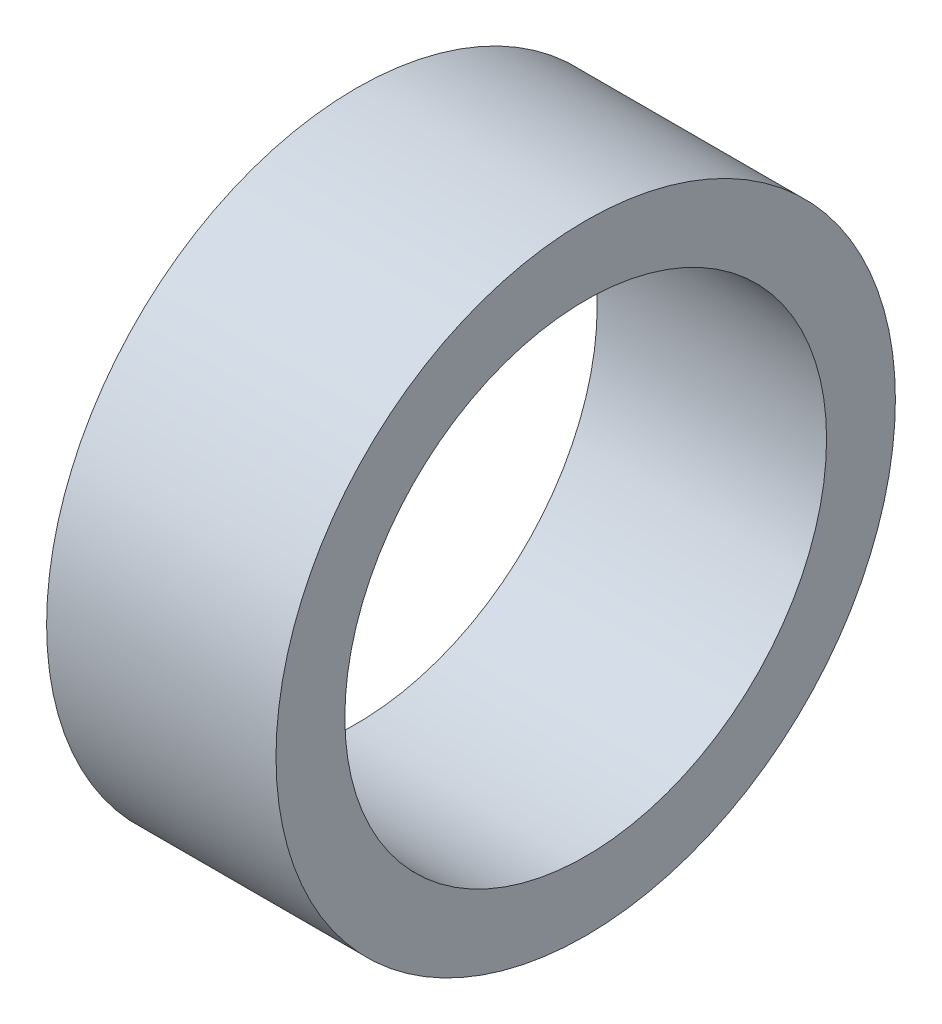
ISO-10303-21;
HEADER;
FILE_DESCRIPTION(('STEP AP214'),'2;1');
FILE_NAME('part.step','',(''),(''),'','','');
FILE_SCHEMA(('AUTOMOTIVE_DESIGN { 1 0 10303 214 1 1 1 1 }'));
ENDSEC;
DATA;
#1=APPLICATION_CONTEXT('core data for automotive mechanical design processes');
#2=APPLICATION_PROTOCOL_DEFINITION('international standard','automotive_design',2000,#1);
#3=PRODUCT_CONTEXT('',#1,'mechanical');
#4=PRODUCT('Part','Part','',(#3));
#5=PRODUCT_RELATED_PRODUCT_CATEGORY('part','',(#4));
#6=PRODUCT_DEFINITION_FORMATION('','',#4);
#7=PRODUCT_DEFINITION_CONTEXT('part definition',#1,'design');
#8=PRODUCT_DEFINITION('design','',#6,#7);
#9=PRODUCT_DEFINITION_SHAPE('','',#8);
#10=(LENGTH_UNIT() NAMED_UNIT(*) SI_UNIT(.MILLI.,.METRE.));
#11=(NAMED_UNIT(*) PLANE_ANGLE_UNIT() SI_UNIT($,.RADIAN.));
#12=(NAMED_UNIT(*) SI_UNIT($,.STERADIAN.) SOLID_ANGLE_UNIT());
#13=UNCERTAINTY_MEASURE_WITH_UNIT(LENGTH_MEASURE(1.E-05),#10,'distance_accuracy_value','');
#14=(GEOMETRIC_REPRESENTATION_CONTEXT(3) GLOBAL_UNCERTAINTY_ASSIGNED_CONTEXT((#13)) GLOBAL_UNIT_ASSIGNED_CONTEXT((#10,
#11,#12)) REPRESENTATION_CONTEXT('',''));
#15=CARTESIAN_POINT('',(0.,0.,0.));
#16=DIRECTION('',(0.,0.,1.));
#17=DIRECTION('',(1.,0.,0.));
#18=AXIS2_PLACEMENT_3D('',#15,#16,#17);
#19=CARTESIAN_POINT('',(5.,0.,0.));
#20=DIRECTION('',(1.,0.,0.));
#21=DIRECTION('',(0.,0.,-1.));
#22=AXIS2_PLACEMENT_3D('',#19,#20,#21);
#23=PLANE('',#22);
#24=CARTESIAN_POINT('',(5.,0.,0.));
#25=DIRECTION('',(1.,0.,0.));
#26=DIRECTION('',(0.,0.,-1.));
#27=AXIS2_PLACEMENT_3D('',#24,#25,#26);
#28=CIRCLE('',#27,6.75);
#29=CARTESIAN_POINT('',(5.,0.,-6.75));
#30=VERTEX_POINT('',#29);
#31=EDGE_CURVE('E10',#30,#30,#28,.T.);
#32=ORIENTED_EDGE('',*,*,#31,.T.);
#33=EDGE_LOOP('',(#32));
#34=FACE_BOUND('',#33,.T.);
#35=CARTESIAN_POINT('',(5.,0.,0.));
#36=DIRECTION('',(1.,0.,0.));
#37=DIRECTION('',(0.,0.,-1.));
#38=AXIS2_PLACEMENT_3D('',#35,#36,#37);
#39=CIRCLE('',#38,5.25);
#40=CARTESIAN_POINT('',(5.,0.,-5.25));
#41=VERTEX_POINT('',#40);
#42=EDGE_CURVE('E43',#41,#41,#39,.T.);
#43=ORIENTED_EDGE('',*,*,#42,.F.);
#44=EDGE_LOOP('',(#43));
#45=FACE_BOUND('',#44,.T.);
#46=ADVANCED_FACE('F32',(#34,#45),#23,.T.);
#47=CARTESIAN_POINT('',(0.,0.,0.));
#48=DIRECTION('',(1.,0.,0.));
#49=DIRECTION('',(0.,0.,-1.));
#50=AXIS2_PLACEMENT_3D('',#47,#48,#49);
#51=PLANE('',#50);
#52=CARTESIAN_POINT('',(0.,0.,0.));
#53=DIRECTION('',(1.,0.,0.));
#54=DIRECTION('',(0.,0.,-1.));
#55=AXIS2_PLACEMENT_3D('',#52,#53,#54);
#56=CIRCLE('',#55,6.75);
#57=CARTESIAN_POINT('',(0.,0.,-6.75));
#58=VERTEX_POINT('',#57);
#59=EDGE_CURVE('E36',#58,#58,#56,.T.);
#60=ORIENTED_EDGE('',*,*,#59,.F.);
#61=EDGE_LOOP('',(#60));
#62=FACE_BOUND('',#61,.T.);
#63=CARTESIAN_POINT('',(0.,0.,0.));
#64=DIRECTION('',(1.,0.,0.));
#65=DIRECTION('',(0.,0.,-1.));
#66=AXIS2_PLACEMENT_3D('',#63,#64,#65);
#67=CIRCLE('',#66,5.25);
#68=CARTESIAN_POINT('',(0.,0.,-5.25));
#69=VERTEX_POINT('',#68);
#70=EDGE_CURVE('E45',#69,#69,#67,.T.);
#71=ORIENTED_EDGE('',*,*,#70,.T.);
#72=EDGE_LOOP('',(#71));
#73=FACE_BOUND('',#72,.T.);
#74=ADVANCED_FACE('F55',(#62,#73),#51,.F.);
#75=CARTESIAN_POINT('',(5.,0.,0.));
#76=DIRECTION('',(-1.,0.,0.));
#77=DIRECTION('',(0.,0.,1.));
#78=AXIS2_PLACEMENT_3D('',#75,#76,#77);
#79=CYLINDRICAL_SURFACE('',#78,6.75);
#80=ORIENTED_EDGE('',*,*,#31,.F.);
#81=EDGE_LOOP('',(#80));
#82=FACE_BOUND('',#81,.T.);
#83=ORIENTED_EDGE('',*,*,#59,.T.);
#84=EDGE_LOOP('',(#83));
#85=FACE_BOUND('',#84,.T.);
#86=ADVANCED_FACE('F34',(#82,#85),#79,.T.);
#87=CARTESIAN_POINT('',(5.,0.,0.));
#88=DIRECTION('',(-1.,0.,0.));
#89=DIRECTION('',(0.,0.,1.));
#90=AXIS2_PLACEMENT_3D('',#87,#88,#89);
#91=CYLINDRICAL_SURFACE('',#90,5.25);
#92=ORIENTED_EDGE('',*,*,#42,.T.);
#93=EDGE_LOOP('',(#92));
#94=FACE_BOUND('',#93,.T.);
#95=ORIENTED_EDGE('',*,*,#70,.F.);
#96=EDGE_LOOP('',(#95));
#97=FACE_BOUND('',#96,.T.);
#98=ADVANCED_FACE('F51',(#94,#97),#91,.F.);
#99=CLOSED_SHELL('',(#46,#74,#86,#98));
#100=MANIFOLD_SOLID_BREP('B2',#99);
#101=ADVANCED_BREP_SHAPE_REPRESENTATION('',(#18,#100),#14);
#102=SHAPE_DEFINITION_REPRESENTATION(#9,#101);
ENDSEC;
END-ISO-10303-21;
